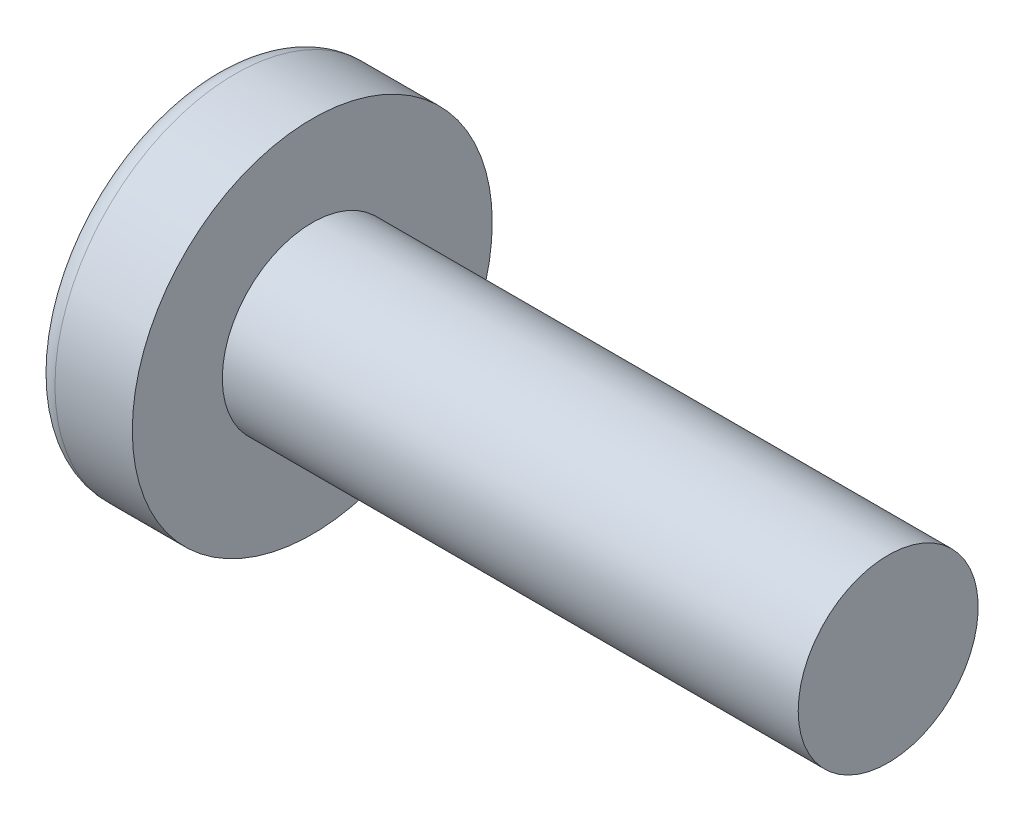
ISO-10303-21;
HEADER;
FILE_DESCRIPTION(('STEP AP214'),'2;1');
FILE_NAME('part.step','',(''),(''),'','','');
FILE_SCHEMA(('AUTOMOTIVE_DESIGN { 1 0 10303 214 1 1 1 1 }'));
ENDSEC;
DATA;
#1=APPLICATION_CONTEXT('core data for automotive mechanical design processes');
#2=APPLICATION_PROTOCOL_DEFINITION('international standard','automotive_design',2000,#1);
#3=PRODUCT_CONTEXT('',#1,'mechanical');
#4=PRODUCT('Part','Part','',(#3));
#5=PRODUCT_RELATED_PRODUCT_CATEGORY('part','',(#4));
#6=PRODUCT_DEFINITION_FORMATION('','',#4);
#7=PRODUCT_DEFINITION_CONTEXT('part definition',#1,'design');
#8=PRODUCT_DEFINITION('design','',#6,#7);
#9=PRODUCT_DEFINITION_SHAPE('','',#8);
#10=(LENGTH_UNIT() NAMED_UNIT(*) SI_UNIT(.MILLI.,.METRE.));
#11=(NAMED_UNIT(*) PLANE_ANGLE_UNIT() SI_UNIT($,.RADIAN.));
#12=(NAMED_UNIT(*) SI_UNIT($,.STERADIAN.) SOLID_ANGLE_UNIT());
#13=UNCERTAINTY_MEASURE_WITH_UNIT(LENGTH_MEASURE(1.E-05),#10,'distance_accuracy_value','');
#14=(GEOMETRIC_REPRESENTATION_CONTEXT(3) GLOBAL_UNCERTAINTY_ASSIGNED_CONTEXT((#13)) GLOBAL_UNIT_ASSIGNED_CONTEXT((#10,
#11,#12)) REPRESENTATION_CONTEXT('',''));
#15=CARTESIAN_POINT('',(0.,0.,0.));
#16=DIRECTION('',(0.,0.,1.));
#17=DIRECTION('',(1.,0.,0.));
#18=AXIS2_PLACEMENT_3D('',#15,#16,#17);
#19=CARTESIAN_POINT('',(4.,0.,0.));
#20=DIRECTION('',(-1.,0.,0.));
#21=DIRECTION('',(0.,1.,0.));
#22=AXIS2_PLACEMENT_3D('',#19,#20,#21);
#23=SPHERICAL_SURFACE('',#22,4.);
#24=CARTESIAN_POINT('',(0.783897344725729,0.,0.));
#25=DIRECTION('',(-1.,0.,0.));
#26=DIRECTION('',(0.,0.,1.));
#27=AXIS2_PLACEMENT_3D('',#24,#25,#26);
#28=CIRCLE('',#27,2.37837837837838);
#29=CARTESIAN_POINT('',(0.783897344725729,0.,2.37837837837838));
#30=VERTEX_POINT('',#29);
#31=EDGE_CURVE('E136',#30,#30,#28,.T.);
#32=ORIENTED_EDGE('',*,*,#31,.T.);
#33=EDGE_LOOP('',(#32));
#34=FACE_BOUND('',#33,.T.);
#35=CARTESIAN_POINT('',(3.98786118636742,-0.106127913473398,0.));
#36=DIRECTION('',(-0.11363816050966,-0.993522203313032,0.));
#37=DIRECTION('',(0.993522203313032,-0.11363816050966,0.));
#38=AXIS2_PLACEMENT_3D('',#35,#36,#37);
#39=CIRCLE('',#38,3.99857343501221);
#40=CARTESIAN_POINT('',(0.195539940029893,0.327634320584812,1.19110847703606));
#41=VERTEX_POINT('',#40);
#42=CARTESIAN_POINT('',(0.0301382525496408,0.346552814250857,0.346552814250858));
#43=VERTEX_POINT('',#42);
#44=EDGE_CURVE('E167',#41,#43,#39,.T.);
#45=ORIENTED_EDGE('',*,*,#44,.F.);
#46=CARTESIAN_POINT('',(3.17784904512422,0.,-1.07973473043772));
#47=DIRECTION('',(0.605808178465614,0.,0.795610740817502));
#48=DIRECTION('',(0.795610740817502,0.,-0.605808178465614));
#49=AXIS2_PLACEMENT_3D('',#46,#47,#48);
#50=CIRCLE('',#49,3.76274377539628);
#51=CARTESIAN_POINT('',(0.195539940029893,-0.327634320584821,1.19110847703606));
#52=VERTEX_POINT('',#51);
#53=EDGE_CURVE('E132',#41,#52,#50,.T.);
#54=ORIENTED_EDGE('',*,*,#53,.T.);
#55=CARTESIAN_POINT('',(3.98786118636742,0.106127913473398,0.));
#56=DIRECTION('',(-0.11363816050966,0.993522203313032,0.));
#57=DIRECTION('',(-0.993522203313032,-0.11363816050966,0.));
#58=AXIS2_PLACEMENT_3D('',#55,#56,#57);
#59=CIRCLE('',#58,3.99857343501221);
#60=CARTESIAN_POINT('',(0.0301382525496399,-0.34655281425086,0.346552814250858));
#61=VERTEX_POINT('',#60);
#62=EDGE_CURVE('E88',#61,#52,#59,.T.);
#63=ORIENTED_EDGE('',*,*,#62,.F.);
#64=CARTESIAN_POINT('',(3.98786118636742,0.,-0.106127913473398));
#65=DIRECTION('',(-0.11363816050966,0.,-0.993522203313032));
#66=DIRECTION('',(-0.993522203313032,0.,0.11363816050966));
#67=AXIS2_PLACEMENT_3D('',#64,#65,#66);
#68=CIRCLE('',#67,3.99857343501221);
#69=CARTESIAN_POINT('',(0.195539940029892,-1.19110847703606,0.327634320584816));
#70=VERTEX_POINT('',#69);
#71=EDGE_CURVE('E113',#70,#61,#68,.T.);
#72=ORIENTED_EDGE('',*,*,#71,.F.);
#73=CARTESIAN_POINT('',(3.17784904512422,1.07973473043772,0.));
#74=DIRECTION('',(0.605808178465614,-0.795610740817502,0.));
#75=DIRECTION('',(0.795610740817502,0.605808178465614,0.));
#76=AXIS2_PLACEMENT_3D('',#73,#74,#75);
#77=CIRCLE('',#76,3.76274377539628);
#78=CARTESIAN_POINT('',(0.195539940029892,-1.19110847703606,-0.327634320584817));
#79=VERTEX_POINT('',#78);
#80=EDGE_CURVE('E121',#70,#79,#77,.T.);
#81=ORIENTED_EDGE('',*,*,#80,.T.);
#82=CARTESIAN_POINT('',(3.98786118636742,0.,0.106127913473398));
#83=DIRECTION('',(-0.11363816050966,0.,0.993522203313032));
#84=DIRECTION('',(0.993522203313032,0.,0.11363816050966));
#85=AXIS2_PLACEMENT_3D('',#82,#83,#84);
#86=CIRCLE('',#85,3.99857343501221);
#87=CARTESIAN_POINT('',(0.0301382525496408,-0.346552814250857,-0.346552814250858));
#88=VERTEX_POINT('',#87);
#89=EDGE_CURVE('E31',#88,#79,#86,.T.);
#90=ORIENTED_EDGE('',*,*,#89,.F.);
#91=CARTESIAN_POINT('',(0.195539940029893,-0.327634320584812,-1.19110847703606));
#92=VERTEX_POINT('',#91);
#93=EDGE_CURVE('E174',#92,#88,#59,.T.);
#94=ORIENTED_EDGE('',*,*,#93,.F.);
#95=CARTESIAN_POINT('',(3.17784904512422,0.,1.07973473043772));
#96=DIRECTION('',(0.605808178465614,0.,-0.795610740817502));
#97=DIRECTION('',(-0.795610740817502,0.,-0.605808178465614));
#98=AXIS2_PLACEMENT_3D('',#95,#96,#97);
#99=CIRCLE('',#98,3.76274377539628);
#100=CARTESIAN_POINT('',(0.195539940029893,0.327634320584821,-1.19110847703606));
#101=VERTEX_POINT('',#100);
#102=EDGE_CURVE('E114',#92,#101,#99,.T.);
#103=ORIENTED_EDGE('',*,*,#102,.T.);
#104=CARTESIAN_POINT('',(0.0301382525496408,0.34655281425086,-0.346552814250858));
#105=VERTEX_POINT('',#104);
#106=EDGE_CURVE('E162',#105,#101,#39,.T.);
#107=ORIENTED_EDGE('',*,*,#106,.F.);
#108=CARTESIAN_POINT('',(0.195539940029893,1.19110847703606,-0.327634320584817));
#109=VERTEX_POINT('',#108);
#110=EDGE_CURVE('E24',#109,#105,#86,.T.);
#111=ORIENTED_EDGE('',*,*,#110,.F.);
#112=CARTESIAN_POINT('',(3.17784904512422,-1.07973473043772,0.));
#113=DIRECTION('',(0.605808178465614,0.795610740817502,0.));
#114=DIRECTION('',(-0.795610740817502,0.605808178465614,0.));
#115=AXIS2_PLACEMENT_3D('',#112,#113,#114);
#116=CIRCLE('',#115,3.76274377539628);
#117=CARTESIAN_POINT('',(0.195539940029893,1.19110847703606,0.327634320584817));
#118=VERTEX_POINT('',#117);
#119=EDGE_CURVE('E11',#109,#118,#116,.T.);
#120=ORIENTED_EDGE('',*,*,#119,.T.);
#121=EDGE_CURVE('E150',#43,#118,#68,.T.);
#122=ORIENTED_EDGE('',*,*,#121,.F.);
#123=EDGE_LOOP('',(#45,#54,#63,#72,#81,#90,#94,#103,#107,#111,#120,#122));
#124=FACE_BOUND('',#123,.T.);
#125=ADVANCED_FACE('F16',(#34,#124),#23,.T.);
#126=CARTESIAN_POINT('',(1.75982832618026,0.,-0.148712446351931));
#127=DIRECTION('',(-0.11363816050966,0.,0.993522203313032));
#128=DIRECTION('',(0.993522203313032,0.,0.11363816050966));
#129=AXIS2_PLACEMENT_3D('',#126,#127,#128);
#130=PLANE('',#129);
#131=ORIENTED_EDGE('',*,*,#110,.T.);
#132=DIRECTION('',(0.987168682960152,-0.112911450665377,0.112911450665377));
#133=VECTOR('',#132,1.);
#134=CARTESIAN_POINT('',(1.77640420924781,0.146816512014139,-0.146816512014139));
#135=LINE('',#134,#133);
#136=CARTESIAN_POINT('',(1.53,0.175,-0.175));
#137=VERTEX_POINT('',#136);
#138=EDGE_CURVE('E156',#105,#137,#135,.T.);
#139=ORIENTED_EDGE('',*,*,#138,.T.);
#140=DIRECTION('',(0.792336746135061,-0.603315234802187,0.0906267520089122));
#141=VECTOR('',#140,1.);
#142=CARTESIAN_POINT('',(0.,1.34,-0.35));
#143=LINE('',#142,#141);
#144=EDGE_CURVE('E137',#109,#137,#143,.T.);
#145=ORIENTED_EDGE('',*,*,#144,.F.);
#146=EDGE_LOOP('',(#131,#139,#145));
#147=FACE_BOUND('',#146,.T.);
#148=ADVANCED_FACE('F155',(#147),#130,.T.);
#149=DIRECTION('',(0.792336746135061,0.603315234802187,0.0906267520089123));
#150=VECTOR('',#149,1.);
#151=CARTESIAN_POINT('',(0.,-1.34,-0.35));
#152=LINE('',#151,#150);
#153=CARTESIAN_POINT('',(1.53,-0.175,-0.175));
#154=VERTEX_POINT('',#153);
#155=EDGE_CURVE('E122',#79,#154,#152,.T.);
#156=ORIENTED_EDGE('',*,*,#155,.T.);
#157=DIRECTION('',(-0.987168682960152,-0.112911450665376,-0.112911450665377));
#158=VECTOR('',#157,1.);
#159=CARTESIAN_POINT('',(1.77640420924781,-0.146816512014138,-0.146816512014139));
#160=LINE('',#159,#158);
#161=EDGE_CURVE('E177',#154,#88,#160,.T.);
#162=ORIENTED_EDGE('',*,*,#161,.T.);
#163=ORIENTED_EDGE('',*,*,#89,.T.);
#164=EDGE_LOOP('',(#156,#162,#163));
#165=FACE_BOUND('',#164,.T.);
#166=ADVANCED_FACE('F192',(#165),#130,.T.);
#167=CARTESIAN_POINT('',(1.75982832618026,0.,0.148712446351931));
#168=DIRECTION('',(-0.11363816050966,0.,-0.993522203313032));
#169=DIRECTION('',(-0.993522203313032,0.,0.11363816050966));
#170=AXIS2_PLACEMENT_3D('',#167,#168,#169);
#171=PLANE('',#170);
#172=DIRECTION('',(0.792336746135061,-0.603315234802187,-0.0906267520089123));
#173=VECTOR('',#172,1.);
#174=CARTESIAN_POINT('',(0.,1.34,0.35));
#175=LINE('',#174,#173);
#176=CARTESIAN_POINT('',(1.53,0.175,0.175));
#177=VERTEX_POINT('',#176);
#178=EDGE_CURVE('E193',#118,#177,#175,.T.);
#179=ORIENTED_EDGE('',*,*,#178,.T.);
#180=DIRECTION('',(-0.987168682960152,0.112911450665376,0.112911450665377));
#181=VECTOR('',#180,1.);
#182=CARTESIAN_POINT('',(1.77640420924781,0.146816512014138,0.146816512014139));
#183=LINE('',#182,#181);
#184=EDGE_CURVE('E171',#177,#43,#183,.T.);
#185=ORIENTED_EDGE('',*,*,#184,.T.);
#186=ORIENTED_EDGE('',*,*,#121,.T.);
#187=EDGE_LOOP('',(#179,#185,#186));
#188=FACE_BOUND('',#187,.T.);
#189=ADVANCED_FACE('F197',(#188),#171,.T.);
#190=ORIENTED_EDGE('',*,*,#71,.T.);
#191=DIRECTION('',(0.987168682960152,0.112911450665377,-0.112911450665377));
#192=VECTOR('',#191,1.);
#193=CARTESIAN_POINT('',(1.77640420924781,-0.14681651201414,0.146816512014139));
#194=LINE('',#193,#192);
#195=CARTESIAN_POINT('',(1.53,-0.175,0.175));
#196=VERTEX_POINT('',#195);
#197=EDGE_CURVE('E86',#61,#196,#194,.T.);
#198=ORIENTED_EDGE('',*,*,#197,.T.);
#199=DIRECTION('',(0.792336746135061,0.603315234802187,-0.0906267520089121));
#200=VECTOR('',#199,1.);
#201=CARTESIAN_POINT('',(0.,-1.34,0.35));
#202=LINE('',#201,#200);
#203=EDGE_CURVE('E111',#70,#196,#202,.T.);
#204=ORIENTED_EDGE('',*,*,#203,.F.);
#205=EDGE_LOOP('',(#190,#198,#204));
#206=FACE_BOUND('',#205,.T.);
#207=ADVANCED_FACE('F110',(#206),#171,.T.);
#208=CARTESIAN_POINT('',(-25.4,0.,0.));
#209=DIRECTION('',(-1.,0.,0.));
#210=DIRECTION('',(0.,0.,1.));
#211=AXIS2_PLACEMENT_3D('',#208,#209,#210);
#212=CYLINDRICAL_SURFACE('',#211,1.25);
#213=CARTESIAN_POINT('',(10.1,0.,0.));
#214=DIRECTION('',(-1.,0.,0.));
#215=DIRECTION('',(0.,0.,1.));
#216=AXIS2_PLACEMENT_3D('',#213,#214,#215);
#217=CIRCLE('',#216,1.25);
#218=CARTESIAN_POINT('',(10.1,0.,1.25));
#219=VERTEX_POINT('',#218);
#220=EDGE_CURVE('E133',#219,#219,#217,.T.);
#221=ORIENTED_EDGE('',*,*,#220,.T.);
#222=EDGE_LOOP('',(#221));
#223=FACE_BOUND('',#222,.T.);
#224=CARTESIAN_POINT('',(2.1,0.,0.));
#225=DIRECTION('',(-1.,0.,0.));
#226=DIRECTION('',(0.,0.,1.));
#227=AXIS2_PLACEMENT_3D('',#224,#225,#226);
#228=CIRCLE('',#227,1.25);
#229=CARTESIAN_POINT('',(2.1,0.,1.25));
#230=VERTEX_POINT('',#229);
#231=EDGE_CURVE('E146',#230,#230,#228,.T.);
#232=ORIENTED_EDGE('',*,*,#231,.F.);
#233=EDGE_LOOP('',(#232));
#234=FACE_BOUND('',#233,.T.);
#235=ADVANCED_FACE('F18',(#223,#234),#212,.T.);
#236=CARTESIAN_POINT('',(2.1,1.25,0.));
#237=DIRECTION('',(-1.,0.,0.));
#238=DIRECTION('',(0.,0.,1.));
#239=AXIS2_PLACEMENT_3D('',#236,#237,#238);
#240=PLANE('',#239);
#241=CARTESIAN_POINT('',(2.1,0.,0.));
#242=DIRECTION('',(-1.,0.,0.));
#243=DIRECTION('',(0.,0.,1.));
#244=AXIS2_PLACEMENT_3D('',#241,#242,#243);
#245=CIRCLE('',#244,2.5);
#246=CARTESIAN_POINT('',(2.1,0.,2.5));
#247=VERTEX_POINT('',#246);
#248=EDGE_CURVE('E143',#247,#247,#245,.T.);
#249=ORIENTED_EDGE('',*,*,#248,.F.);
#250=EDGE_LOOP('',(#249));
#251=FACE_BOUND('',#250,.T.);
#252=ORIENTED_EDGE('',*,*,#231,.T.);
#253=EDGE_LOOP('',(#252));
#254=FACE_BOUND('',#253,.T.);
#255=ADVANCED_FACE('F226',(#251,#254),#240,.F.);
#256=CARTESIAN_POINT('',(-25.4,0.,0.));
#257=DIRECTION('',(-1.,0.,0.));
#258=DIRECTION('',(0.,0.,1.));
#259=AXIS2_PLACEMENT_3D('',#256,#257,#258);
#260=CYLINDRICAL_SURFACE('',#259,2.5);
#261=ORIENTED_EDGE('',*,*,#248,.T.);
#262=EDGE_LOOP('',(#261));
#263=FACE_BOUND('',#262,.T.);
#264=CARTESIAN_POINT('',(1.0251050438713,0.,0.));
#265=DIRECTION('',(-1.,0.,0.));
#266=DIRECTION('',(0.,0.,1.));
#267=AXIS2_PLACEMENT_3D('',#264,#265,#266);
#268=CIRCLE('',#267,2.5);
#269=CARTESIAN_POINT('',(1.0251050438713,0.,2.5));
#270=VERTEX_POINT('',#269);
#271=EDGE_CURVE('E140',#270,#270,#268,.T.);
#272=ORIENTED_EDGE('',*,*,#271,.F.);
#273=EDGE_LOOP('',(#272));
#274=FACE_BOUND('',#273,.T.);
#275=ADVANCED_FACE('F223',(#263,#274),#260,.T.);
#276=CARTESIAN_POINT('',(1.0251050438713,0.,0.));
#277=DIRECTION('',(-1.,0.,0.));
#278=DIRECTION('',(0.,0.,1.));
#279=AXIS2_PLACEMENT_3D('',#276,#277,#278);
#280=TOROIDAL_SURFACE('',#279,2.2,0.3);
#281=ORIENTED_EDGE('',*,*,#271,.T.);
#282=EDGE_LOOP('',(#281));
#283=FACE_BOUND('',#282,.T.);
#284=ORIENTED_EDGE('',*,*,#31,.F.);
#285=EDGE_LOOP('',(#284));
#286=FACE_BOUND('',#285,.T.);
#287=ADVANCED_FACE('F220',(#283,#286),#280,.T.);
#288=CARTESIAN_POINT('',(10.1,1.25,0.));
#289=DIRECTION('',(1.,0.,0.));
#290=DIRECTION('',(0.,0.,-1.));
#291=AXIS2_PLACEMENT_3D('',#288,#289,#290);
#292=PLANE('',#291);
#293=ORIENTED_EDGE('',*,*,#220,.F.);
#294=EDGE_LOOP('',(#293));
#295=FACE_BOUND('',#294,.T.);
#296=ADVANCED_FACE('F218',(#295),#292,.T.);
#297=CARTESIAN_POINT('',(1.53,0.175,0.175));
#298=DIRECTION('',(0.605808178465614,0.795610740817502,0.));
#299=DIRECTION('',(-0.795610740817502,0.605808178465614,0.));
#300=AXIS2_PLACEMENT_3D('',#297,#298,#299);
#301=PLANE('',#300);
#302=ORIENTED_EDGE('',*,*,#144,.T.);
#303=DIRECTION('',(0.,0.,-1.));
#304=VECTOR('',#303,1.);
#305=CARTESIAN_POINT('',(1.53,0.175,0.175));
#306=LINE('',#305,#304);
#307=EDGE_CURVE('E104',#177,#137,#306,.T.);
#308=ORIENTED_EDGE('',*,*,#307,.F.);
#309=ORIENTED_EDGE('',*,*,#178,.F.);
#310=ORIENTED_EDGE('',*,*,#119,.F.);
#311=EDGE_LOOP('',(#302,#308,#309,#310));
#312=FACE_BOUND('',#311,.T.);
#313=ADVANCED_FACE('F196',(#312),#301,.F.);
#314=CARTESIAN_POINT('',(1.53,-0.175,-0.175));
#315=DIRECTION('',(0.605808178465614,-0.795610740817502,0.));
#316=DIRECTION('',(0.795610740817502,0.605808178465614,0.));
#317=AXIS2_PLACEMENT_3D('',#314,#315,#316);
#318=PLANE('',#317);
#319=ORIENTED_EDGE('',*,*,#203,.T.);
#320=DIRECTION('',(0.,0.,1.));
#321=VECTOR('',#320,1.);
#322=CARTESIAN_POINT('',(1.53,-0.175,-0.175));
#323=LINE('',#322,#321);
#324=EDGE_CURVE('E103',#154,#196,#323,.T.);
#325=ORIENTED_EDGE('',*,*,#324,.F.);
#326=ORIENTED_EDGE('',*,*,#155,.F.);
#327=ORIENTED_EDGE('',*,*,#80,.F.);
#328=EDGE_LOOP('',(#319,#325,#326,#327));
#329=FACE_BOUND('',#328,.T.);
#330=ADVANCED_FACE('F118',(#329),#318,.F.);
#331=CARTESIAN_POINT('',(1.53,0.175,-0.175));
#332=DIRECTION('',(-1.,0.,0.));
#333=DIRECTION('',(0.,0.,1.));
#334=AXIS2_PLACEMENT_3D('',#331,#332,#333);
#335=PLANE('',#334);
#336=DIRECTION('',(0.,1.,0.));
#337=VECTOR('',#336,1.);
#338=CARTESIAN_POINT('',(1.53,-0.175,-0.175));
#339=LINE('',#338,#337);
#340=EDGE_CURVE('E126',#154,#137,#339,.T.);
#341=ORIENTED_EDGE('',*,*,#340,.F.);
#342=ORIENTED_EDGE('',*,*,#324,.T.);
#343=DIRECTION('',(0.,-1.,0.));
#344=VECTOR('',#343,1.);
#345=CARTESIAN_POINT('',(1.53,0.175,0.175));
#346=LINE('',#345,#344);
#347=EDGE_CURVE('E95',#177,#196,#346,.T.);
#348=ORIENTED_EDGE('',*,*,#347,.F.);
#349=ORIENTED_EDGE('',*,*,#307,.T.);
#350=EDGE_LOOP('',(#341,#342,#348,#349));
#351=FACE_BOUND('',#350,.T.);
#352=ADVANCED_FACE('F124',(#351),#335,.T.);
#353=CARTESIAN_POINT('',(1.53,0.175,-0.175));
#354=DIRECTION('',(0.605808178465614,0.,-0.795610740817502));
#355=DIRECTION('',(0.795610740817502,0.,0.605808178465614));
#356=AXIS2_PLACEMENT_3D('',#353,#354,#355);
#357=PLANE('',#356);
#358=DIRECTION('',(0.792336746135061,0.09062675200891,0.603315234802188));
#359=VECTOR('',#358,1.);
#360=CARTESIAN_POINT('',(0.,-0.349999999999995,-1.34));
#361=LINE('',#360,#359);
#362=EDGE_CURVE('E182',#92,#154,#361,.T.);
#363=ORIENTED_EDGE('',*,*,#362,.T.);
#364=ORIENTED_EDGE('',*,*,#340,.T.);
#365=DIRECTION('',(0.792336746135061,-0.0906267520089144,0.603315234802187));
#366=VECTOR('',#365,1.);
#367=CARTESIAN_POINT('',(0.,0.350000000000004,-1.34));
#368=LINE('',#367,#366);
#369=EDGE_CURVE('E92',#101,#137,#368,.T.);
#370=ORIENTED_EDGE('',*,*,#369,.F.);
#371=ORIENTED_EDGE('',*,*,#102,.F.);
#372=EDGE_LOOP('',(#363,#364,#370,#371));
#373=FACE_BOUND('',#372,.T.);
#374=ADVANCED_FACE('F187',(#373),#357,.F.);
#375=CARTESIAN_POINT('',(1.75982832618026,-0.148712446351931,0.));
#376=DIRECTION('',(-0.11363816050966,0.993522203313032,0.));
#377=DIRECTION('',(-0.993522203313032,-0.11363816050966,0.));
#378=AXIS2_PLACEMENT_3D('',#375,#376,#377);
#379=PLANE('',#378);
#380=ORIENTED_EDGE('',*,*,#93,.T.);
#381=ORIENTED_EDGE('',*,*,#161,.F.);
#382=ORIENTED_EDGE('',*,*,#362,.F.);
#383=EDGE_LOOP('',(#380,#381,#382));
#384=FACE_BOUND('',#383,.T.);
#385=ADVANCED_FACE('F191',(#384),#379,.T.);
#386=CARTESIAN_POINT('',(1.75982832618026,0.148712446351931,0.));
#387=DIRECTION('',(-0.11363816050966,-0.993522203313032,0.));
#388=DIRECTION('',(0.993522203313032,-0.11363816050966,0.));
#389=AXIS2_PLACEMENT_3D('',#386,#387,#388);
#390=PLANE('',#389);
#391=ORIENTED_EDGE('',*,*,#106,.T.);
#392=ORIENTED_EDGE('',*,*,#369,.T.);
#393=ORIENTED_EDGE('',*,*,#138,.F.);
#394=EDGE_LOOP('',(#391,#392,#393));
#395=FACE_BOUND('',#394,.T.);
#396=ADVANCED_FACE('F185',(#395),#390,.T.);
#397=CARTESIAN_POINT('',(1.53,-0.175,0.175));
#398=DIRECTION('',(0.605808178465614,0.,0.795610740817502));
#399=DIRECTION('',(-0.795610740817502,0.,0.605808178465614));
#400=AXIS2_PLACEMENT_3D('',#397,#398,#399);
#401=PLANE('',#400);
#402=DIRECTION('',(0.792336746135061,-0.0906267520089101,-0.603315234802188));
#403=VECTOR('',#402,1.);
#404=CARTESIAN_POINT('',(0.,0.349999999999995,1.34));
#405=LINE('',#404,#403);
#406=EDGE_CURVE('E91',#41,#177,#405,.T.);
#407=ORIENTED_EDGE('',*,*,#406,.T.);
#408=ORIENTED_EDGE('',*,*,#347,.T.);
#409=DIRECTION('',(0.792336746135061,0.0906267520089144,-0.603315234802187));
#410=VECTOR('',#409,1.);
#411=CARTESIAN_POINT('',(0.,-0.350000000000004,1.34));
#412=LINE('',#411,#410);
#413=EDGE_CURVE('E82',#52,#196,#412,.T.);
#414=ORIENTED_EDGE('',*,*,#413,.F.);
#415=ORIENTED_EDGE('',*,*,#53,.F.);
#416=EDGE_LOOP('',(#407,#408,#414,#415));
#417=FACE_BOUND('',#416,.T.);
#418=ADVANCED_FACE('F96',(#417),#401,.F.);
#419=ORIENTED_EDGE('',*,*,#44,.T.);
#420=ORIENTED_EDGE('',*,*,#184,.F.);
#421=ORIENTED_EDGE('',*,*,#406,.F.);
#422=EDGE_LOOP('',(#419,#420,#421));
#423=FACE_BOUND('',#422,.T.);
#424=ADVANCED_FACE('F198',(#423),#390,.T.);
#425=ORIENTED_EDGE('',*,*,#62,.T.);
#426=ORIENTED_EDGE('',*,*,#413,.T.);
#427=ORIENTED_EDGE('',*,*,#197,.F.);
#428=EDGE_LOOP('',(#425,#426,#427));
#429=FACE_BOUND('',#428,.T.);
#430=ADVANCED_FACE('F84',(#429),#379,.T.);
#431=CLOSED_SHELL('',(#125,#148,#166,#189,#207,#235,#255,#275,#287,#296,#313,#330,#352,#374,
#385,#396,#418,#424,#430));
#432=MANIFOLD_SOLID_BREP('B1',#431);
#433=ADVANCED_BREP_SHAPE_REPRESENTATION('',(#18,#432),#14);
#434=SHAPE_DEFINITION_REPRESENTATION(#9,#433);
ENDSEC;
END-ISO-10303-21;
